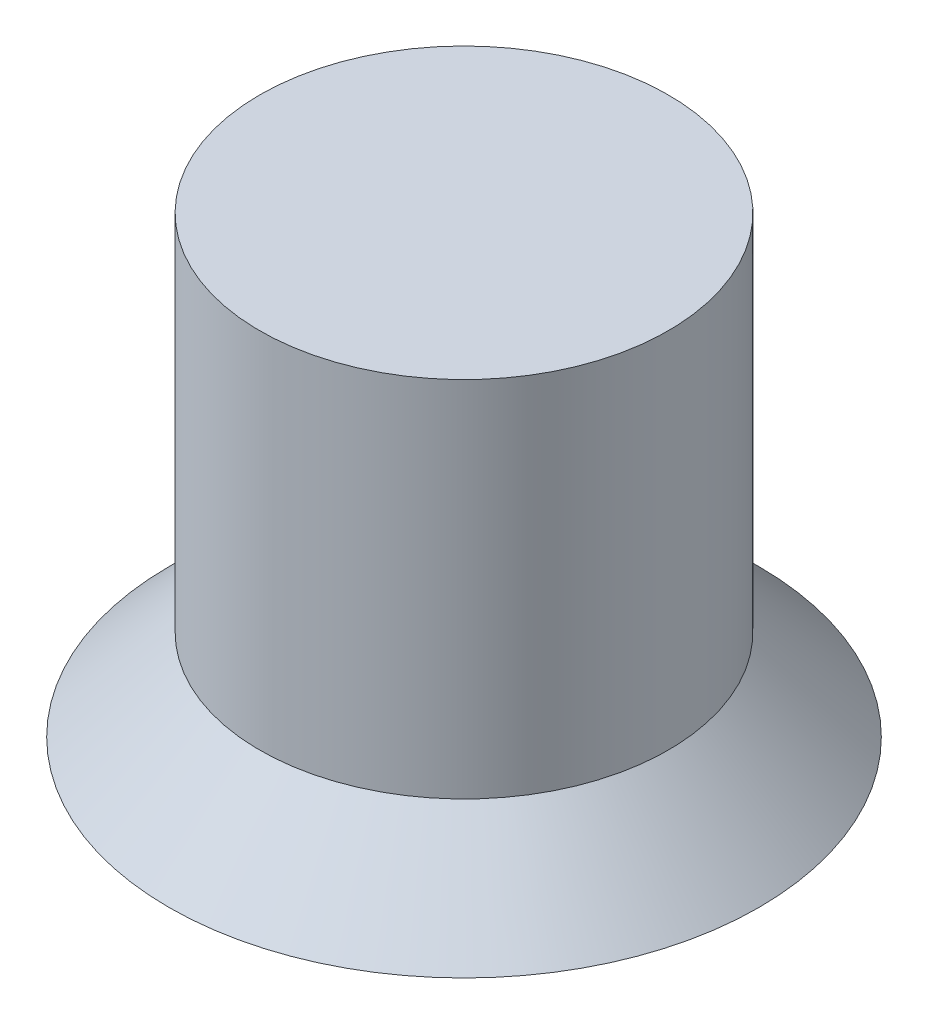
ISO-10303-21;
HEADER;
FILE_DESCRIPTION(('STEP AP214'),'2;1');
FILE_NAME('part.step','',(''),(''),'','','');
FILE_SCHEMA(('AUTOMOTIVE_DESIGN { 1 0 10303 214 1 1 1 1 }'));
ENDSEC;
DATA;
#1=APPLICATION_CONTEXT('core data for automotive mechanical design processes');
#2=APPLICATION_PROTOCOL_DEFINITION('international standard','automotive_design',2000,#1);
#3=PRODUCT_CONTEXT('',#1,'mechanical');
#4=PRODUCT('Part','Part','',(#3));
#5=PRODUCT_RELATED_PRODUCT_CATEGORY('part','',(#4));
#6=PRODUCT_DEFINITION_FORMATION('','',#4);
#7=PRODUCT_DEFINITION_CONTEXT('part definition',#1,'design');
#8=PRODUCT_DEFINITION('design','',#6,#7);
#9=PRODUCT_DEFINITION_SHAPE('','',#8);
#10=(LENGTH_UNIT() NAMED_UNIT(*) SI_UNIT(.MILLI.,.METRE.));
#11=(NAMED_UNIT(*) PLANE_ANGLE_UNIT() SI_UNIT($,.RADIAN.));
#12=(NAMED_UNIT(*) SI_UNIT($,.STERADIAN.) SOLID_ANGLE_UNIT());
#13=UNCERTAINTY_MEASURE_WITH_UNIT(LENGTH_MEASURE(1.E-05),#10,'distance_accuracy_value','');
#14=(GEOMETRIC_REPRESENTATION_CONTEXT(3) GLOBAL_UNCERTAINTY_ASSIGNED_CONTEXT((#13)) GLOBAL_UNIT_ASSIGNED_CONTEXT((#10,
#11,#12)) REPRESENTATION_CONTEXT('',''));
#15=CARTESIAN_POINT('',(0.,0.,0.));
#16=DIRECTION('',(0.,0.,1.));
#17=DIRECTION('',(1.,0.,0.));
#18=AXIS2_PLACEMENT_3D('',#15,#16,#17);
#19=CARTESIAN_POINT('',(0.,0.,0.));
#20=DIRECTION('',(0.,1.,0.));
#21=DIRECTION('',(-1.,0.,0.));
#22=AXIS2_PLACEMENT_3D('',#19,#20,#21);
#23=PLANE('',#22);
#24=CARTESIAN_POINT('',(4.,0.,0.));
#25=DIRECTION('',(0.,1.,0.));
#26=DIRECTION('',(-1.,0.,0.));
#27=AXIS2_PLACEMENT_3D('',#24,#25,#26);
#28=CIRCLE('',#27,1.5);
#29=CARTESIAN_POINT('',(2.5,0.,0.));
#30=VERTEX_POINT('',#29);
#31=EDGE_CURVE('E42',#30,#30,#28,.F.);
#32=ORIENTED_EDGE('',*,*,#31,.F.);
#33=EDGE_LOOP('',(#32));
#34=FACE_BOUND('',#33,.T.);
#35=CARTESIAN_POINT('',(0.,0.,0.));
#36=DIRECTION('',(0.,1.,0.));
#37=DIRECTION('',(-1.,0.,0.));
#38=AXIS2_PLACEMENT_3D('',#35,#36,#37);
#39=CIRCLE('',#38,6.5);
#40=CARTESIAN_POINT('',(-6.5,0.,0.));
#41=VERTEX_POINT('',#40);
#42=EDGE_CURVE('E46',#41,#41,#39,.T.);
#43=ORIENTED_EDGE('',*,*,#42,.F.);
#44=EDGE_LOOP('',(#43));
#45=FACE_BOUND('',#44,.T.);
#46=ADVANCED_FACE('F31',(#34,#45),#23,.F.);
#47=CARTESIAN_POINT('',(0.,0.,0.));
#48=DIRECTION('',(0.,-1.,0.));
#49=DIRECTION('',(1.,0.,0.));
#50=AXIS2_PLACEMENT_3D('',#47,#48,#49);
#51=CONICAL_SURFACE('',#50,6.5,0.785398163397454);
#52=CARTESIAN_POINT('',(0.,1.99999999999998,0.));
#53=DIRECTION('',(0.,1.,0.));
#54=DIRECTION('',(-1.,0.,0.));
#55=AXIS2_PLACEMENT_3D('',#52,#53,#54);
#56=CIRCLE('',#55,4.5);
#57=CARTESIAN_POINT('',(-4.5,1.99999999999998,0.));
#58=VERTEX_POINT('',#57);
#59=EDGE_CURVE('E51',#58,#58,#56,.T.);
#60=ORIENTED_EDGE('',*,*,#59,.F.);
#61=EDGE_LOOP('',(#60));
#62=FACE_BOUND('',#61,.T.);
#63=ORIENTED_EDGE('',*,*,#42,.T.);
#64=EDGE_LOOP('',(#63));
#65=FACE_BOUND('',#64,.T.);
#66=ADVANCED_FACE('F63',(#62,#65),#51,.T.);
#67=CARTESIAN_POINT('',(0.,10.,0.));
#68=DIRECTION('',(0.,1.,0.));
#69=DIRECTION('',(-1.,0.,0.));
#70=AXIS2_PLACEMENT_3D('',#67,#68,#69);
#71=CYLINDRICAL_SURFACE('',#70,4.5);
#72=CARTESIAN_POINT('',(0.,10.,0.));
#73=DIRECTION('',(0.,1.,0.));
#74=DIRECTION('',(-1.,0.,0.));
#75=AXIS2_PLACEMENT_3D('',#72,#73,#74);
#76=CIRCLE('',#75,4.5);
#77=CARTESIAN_POINT('',(-4.5,10.,0.));
#78=VERTEX_POINT('',#77);
#79=EDGE_CURVE('E54',#78,#78,#76,.T.);
#80=ORIENTED_EDGE('',*,*,#79,.F.);
#81=EDGE_LOOP('',(#80));
#82=FACE_BOUND('',#81,.T.);
#83=ORIENTED_EDGE('',*,*,#59,.T.);
#84=EDGE_LOOP('',(#83));
#85=FACE_BOUND('',#84,.T.);
#86=ADVANCED_FACE('F60',(#82,#85),#71,.T.);
#87=CARTESIAN_POINT('',(4.5,10.,0.));
#88=DIRECTION('',(0.,-1.,0.));
#89=DIRECTION('',(1.,0.,0.));
#90=AXIS2_PLACEMENT_3D('',#87,#88,#89);
#91=PLANE('',#90);
#92=ORIENTED_EDGE('',*,*,#79,.T.);
#93=EDGE_LOOP('',(#92));
#94=FACE_BOUND('',#93,.T.);
#95=ADVANCED_FACE('F58',(#94),#91,.F.);
#96=CARTESIAN_POINT('',(4.,-0.5,0.));
#97=DIRECTION('',(0.,1.,0.));
#98=DIRECTION('',(-1.,0.,0.));
#99=AXIS2_PLACEMENT_3D('',#96,#97,#98);
#100=CYLINDRICAL_SURFACE('',#99,1.5);
#101=CARTESIAN_POINT('',(4.,-0.2,0.));
#102=DIRECTION('',(0.,-1.,0.));
#103=DIRECTION('',(1.,0.,0.));
#104=AXIS2_PLACEMENT_3D('',#101,#102,#103);
#105=CIRCLE('',#104,1.5);
#106=CARTESIAN_POINT('',(5.5,-0.2,0.));
#107=VERTEX_POINT('',#106);
#108=EDGE_CURVE('E10',#107,#107,#105,.F.);
#109=ORIENTED_EDGE('',*,*,#108,.T.);
#110=EDGE_LOOP('',(#109));
#111=FACE_BOUND('',#110,.T.);
#112=ORIENTED_EDGE('',*,*,#31,.T.);
#113=EDGE_LOOP('',(#112));
#114=FACE_BOUND('',#113,.T.);
#115=ADVANCED_FACE('F82',(#111,#114),#100,.T.);
#116=CARTESIAN_POINT('',(4.,-0.5,0.));
#117=DIRECTION('',(0.,-1.,0.));
#118=DIRECTION('',(1.,0.,0.));
#119=AXIS2_PLACEMENT_3D('',#116,#117,#118);
#120=PLANE('',#119);
#121=CARTESIAN_POINT('',(4.,-0.5,0.));
#122=DIRECTION('',(0.,-1.,0.));
#123=DIRECTION('',(1.,0.,0.));
#124=AXIS2_PLACEMENT_3D('',#121,#122,#123);
#125=CIRCLE('',#124,1.2);
#126=CARTESIAN_POINT('',(5.2,-0.5,0.));
#127=VERTEX_POINT('',#126);
#128=EDGE_CURVE('E38',#127,#127,#125,.T.);
#129=ORIENTED_EDGE('',*,*,#128,.T.);
#130=EDGE_LOOP('',(#129));
#131=FACE_BOUND('',#130,.T.);
#132=ADVANCED_FACE('F85',(#131),#120,.T.);
#133=CARTESIAN_POINT('',(4.,-0.2,0.));
#134=DIRECTION('',(0.,-1.,0.));
#135=DIRECTION('',(1.,0.,0.));
#136=AXIS2_PLACEMENT_3D('',#133,#134,#135);
#137=TOROIDAL_SURFACE('',#136,1.2,0.3);
#138=ORIENTED_EDGE('',*,*,#108,.F.);
#139=EDGE_LOOP('',(#138));
#140=FACE_BOUND('',#139,.T.);
#141=ORIENTED_EDGE('',*,*,#128,.F.);
#142=EDGE_LOOP('',(#141));
#143=FACE_BOUND('',#142,.T.);
#144=ADVANCED_FACE('F33',(#140,#143),#137,.T.);
#145=CLOSED_SHELL('',(#46,#66,#86,#95,#115,#132,#144));
#146=MANIFOLD_SOLID_BREP('B2',#145);
#147=ADVANCED_BREP_SHAPE_REPRESENTATION('',(#18,#146),#14);
#148=SHAPE_DEFINITION_REPRESENTATION(#9,#147);
ENDSEC;
END-ISO-10303-21;
